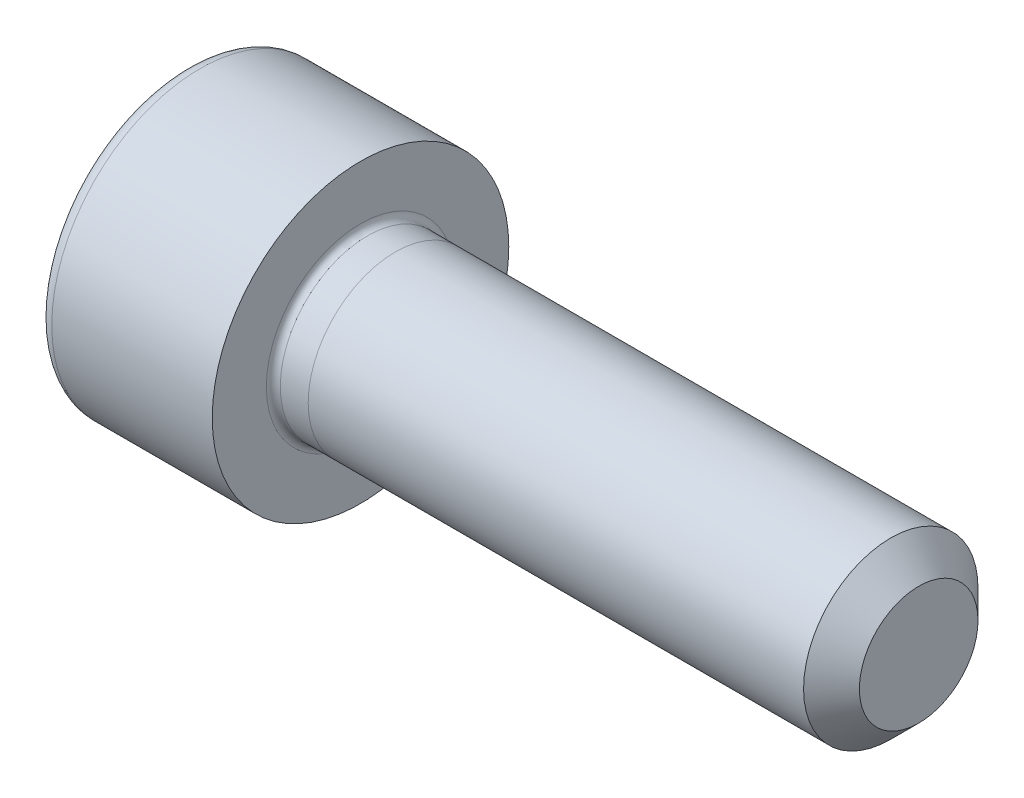
ISO-10303-21;
HEADER;
FILE_DESCRIPTION(('STEP AP214'),'2;1');
FILE_NAME('part.step','',(''),(''),'','','');
FILE_SCHEMA(('AUTOMOTIVE_DESIGN { 1 0 10303 214 1 1 1 1 }'));
ENDSEC;
DATA;
#1=APPLICATION_CONTEXT('core data for automotive mechanical design processes');
#2=APPLICATION_PROTOCOL_DEFINITION('international standard','automotive_design',2000,#1);
#3=PRODUCT_CONTEXT('',#1,'mechanical');
#4=PRODUCT('Part','Part','',(#3));
#5=PRODUCT_RELATED_PRODUCT_CATEGORY('part','',(#4));
#6=PRODUCT_DEFINITION_FORMATION('','',#4);
#7=PRODUCT_DEFINITION_CONTEXT('part definition',#1,'design');
#8=PRODUCT_DEFINITION('design','',#6,#7);
#9=PRODUCT_DEFINITION_SHAPE('','',#8);
#10=(LENGTH_UNIT() NAMED_UNIT(*) SI_UNIT(.MILLI.,.METRE.));
#11=(NAMED_UNIT(*) PLANE_ANGLE_UNIT() SI_UNIT($,.RADIAN.));
#12=(NAMED_UNIT(*) SI_UNIT($,.STERADIAN.) SOLID_ANGLE_UNIT());
#13=UNCERTAINTY_MEASURE_WITH_UNIT(LENGTH_MEASURE(1.E-05),#10,'distance_accuracy_value','');
#14=(GEOMETRIC_REPRESENTATION_CONTEXT(3) GLOBAL_UNCERTAINTY_ASSIGNED_CONTEXT((#13)) GLOBAL_UNIT_ASSIGNED_CONTEXT((#10,
#11,#12)) REPRESENTATION_CONTEXT('',''));
#15=CARTESIAN_POINT('',(0.,0.,0.));
#16=DIRECTION('',(0.,0.,1.));
#17=DIRECTION('',(1.,0.,0.));
#18=AXIS2_PLACEMENT_3D('',#15,#16,#17);
#19=CARTESIAN_POINT('',(16.,0.,0.));
#20=DIRECTION('',(-1.,0.,0.));
#21=DIRECTION('',(0.,0.,1.));
#22=AXIS2_PLACEMENT_3D('',#19,#20,#21);
#23=CYLINDRICAL_SURFACE('',#22,2.5);
#24=CARTESIAN_POINT('',(0.199999999999978,0.,0.));
#25=DIRECTION('',(-1.,0.,0.));
#26=DIRECTION('',(0.,0.,1.));
#27=AXIS2_PLACEMENT_3D('',#24,#25,#26);
#28=CIRCLE('',#27,2.5);
#29=CARTESIAN_POINT('',(0.199999999999978,0.,2.5));
#30=VERTEX_POINT('',#29);
#31=EDGE_CURVE('E180',#30,#30,#28,.F.);
#32=ORIENTED_EDGE('',*,*,#31,.T.);
#33=EDGE_LOOP('',(#32));
#34=FACE_BOUND('',#33,.T.);
#35=CARTESIAN_POINT('',(1.,0.,0.));
#36=DIRECTION('',(1.,0.,0.));
#37=DIRECTION('',(0.,1.,0.));
#38=AXIS2_PLACEMENT_3D('',#35,#36,#37);
#39=CIRCLE('',#38,2.5);
#40=CARTESIAN_POINT('',(1.,2.49999999999997,0.));
#41=VERTEX_POINT('',#40);
#42=EDGE_CURVE('E11',#41,#41,#39,.T.);
#43=ORIENTED_EDGE('',*,*,#42,.F.);
#44=EDGE_LOOP('',(#43));
#45=FACE_BOUND('',#44,.T.);
#46=ADVANCED_FACE('F38',(#34,#45),#23,.T.);
#47=ORIENTED_EDGE('',*,*,#42,.T.);
#48=EDGE_LOOP('',(#47));
#49=FACE_BOUND('',#48,.T.);
#50=CARTESIAN_POINT('',(15.2,0.,0.));
#51=DIRECTION('',(1.,0.,0.));
#52=DIRECTION('',(0.,0.,-1.));
#53=AXIS2_PLACEMENT_3D('',#50,#51,#52);
#54=CIRCLE('',#53,2.5);
#55=CARTESIAN_POINT('',(15.2,0.,-2.49999999999996));
#56=VERTEX_POINT('',#55);
#57=EDGE_CURVE('E168',#56,#56,#54,.F.);
#58=ORIENTED_EDGE('',*,*,#57,.T.);
#59=EDGE_LOOP('',(#58));
#60=FACE_BOUND('',#59,.T.);
#61=ADVANCED_FACE('F277',(#49,#60),#23,.T.);
#62=CARTESIAN_POINT('',(16.,0.,0.));
#63=DIRECTION('',(1.,0.,0.));
#64=DIRECTION('',(0.,0.,-1.));
#65=AXIS2_PLACEMENT_3D('',#62,#63,#64);
#66=PLANE('',#65);
#67=CARTESIAN_POINT('',(16.,0.,0.));
#68=DIRECTION('',(1.,0.,0.));
#69=DIRECTION('',(0.,0.,-1.));
#70=AXIS2_PLACEMENT_3D('',#67,#68,#69);
#71=CIRCLE('',#70,1.7);
#72=CARTESIAN_POINT('',(16.,0.,-1.7));
#73=VERTEX_POINT('',#72);
#74=EDGE_CURVE('E165',#73,#73,#71,.T.);
#75=ORIENTED_EDGE('',*,*,#74,.T.);
#76=EDGE_LOOP('',(#75));
#77=FACE_BOUND('',#76,.T.);
#78=ADVANCED_FACE('F283',(#77),#66,.T.);
#79=CARTESIAN_POINT('',(0.,0.,0.));
#80=DIRECTION('',(-1.,0.,0.));
#81=DIRECTION('',(0.,0.,1.));
#82=AXIS2_PLACEMENT_3D('',#79,#80,#81);
#83=PLANE('',#82);
#84=CARTESIAN_POINT('',(0.,0.,0.));
#85=DIRECTION('',(-1.,0.,0.));
#86=DIRECTION('',(0.,0.,1.));
#87=AXIS2_PLACEMENT_3D('',#84,#85,#86);
#88=CIRCLE('',#87,2.7);
#89=CARTESIAN_POINT('',(0.,0.,2.7));
#90=VERTEX_POINT('',#89);
#91=EDGE_CURVE('E177',#90,#90,#88,.T.);
#92=ORIENTED_EDGE('',*,*,#91,.T.);
#93=EDGE_LOOP('',(#92));
#94=FACE_BOUND('',#93,.T.);
#95=CARTESIAN_POINT('',(0.,0.,0.));
#96=DIRECTION('',(-1.,0.,0.));
#97=DIRECTION('',(0.,0.,1.));
#98=AXIS2_PLACEMENT_3D('',#95,#96,#97);
#99=CIRCLE('',#98,4.25);
#100=CARTESIAN_POINT('',(0.,0.,4.25));
#101=VERTEX_POINT('',#100);
#102=EDGE_CURVE('E162',#101,#101,#99,.T.);
#103=ORIENTED_EDGE('',*,*,#102,.F.);
#104=EDGE_LOOP('',(#103));
#105=FACE_BOUND('',#104,.T.);
#106=ADVANCED_FACE('F309',(#94,#105),#83,.F.);
#107=CARTESIAN_POINT('',(-5.,0.,0.));
#108=DIRECTION('',(1.,0.,0.));
#109=DIRECTION('',(0.,0.,-1.));
#110=AXIS2_PLACEMENT_3D('',#107,#108,#109);
#111=CYLINDRICAL_SURFACE('',#110,4.25);
#112=CARTESIAN_POINT('',(-4.59999999999999,0.,0.));
#113=DIRECTION('',(-1.,0.,0.));
#114=DIRECTION('',(0.,0.,1.));
#115=AXIS2_PLACEMENT_3D('',#112,#113,#114);
#116=CIRCLE('',#115,4.25);
#117=CARTESIAN_POINT('',(-4.59999999999999,0.,4.25000000000001));
#118=VERTEX_POINT('',#117);
#119=EDGE_CURVE('E174',#118,#118,#116,.F.);
#120=ORIENTED_EDGE('',*,*,#119,.T.);
#121=EDGE_LOOP('',(#120));
#122=FACE_BOUND('',#121,.T.);
#123=ORIENTED_EDGE('',*,*,#102,.T.);
#124=EDGE_LOOP('',(#123));
#125=FACE_BOUND('',#124,.T.);
#126=ADVANCED_FACE('F312',(#122,#125),#111,.T.);
#127=CARTESIAN_POINT('',(-5.,0.,0.));
#128=DIRECTION('',(-1.,0.,0.));
#129=DIRECTION('',(0.,0.,1.));
#130=AXIS2_PLACEMENT_3D('',#127,#128,#129);
#131=PLANE('',#130);
#132=CARTESIAN_POINT('',(-5.,0.,0.));
#133=DIRECTION('',(-1.,0.,0.));
#134=DIRECTION('',(0.,0.,1.));
#135=AXIS2_PLACEMENT_3D('',#132,#133,#134);
#136=CIRCLE('',#135,2.4);
#137=CARTESIAN_POINT('',(-5.,0.,2.40000000000001));
#138=VERTEX_POINT('',#137);
#139=EDGE_CURVE('E183',#138,#138,#136,.F.);
#140=ORIENTED_EDGE('',*,*,#139,.T.);
#141=EDGE_LOOP('',(#140));
#142=FACE_BOUND('',#141,.T.);
#143=CARTESIAN_POINT('',(-5.,0.,0.));
#144=DIRECTION('',(-1.,0.,0.));
#145=DIRECTION('',(0.,0.,1.));
#146=AXIS2_PLACEMENT_3D('',#143,#144,#145);
#147=CIRCLE('',#146,3.85);
#148=CARTESIAN_POINT('',(-5.00000000000001,0.,3.85000000000001));
#149=VERTEX_POINT('',#148);
#150=EDGE_CURVE('E171',#149,#149,#147,.T.);
#151=ORIENTED_EDGE('',*,*,#150,.T.);
#152=EDGE_LOOP('',(#151));
#153=FACE_BOUND('',#152,.T.);
#154=ADVANCED_FACE('F293',(#142,#153),#131,.T.);
#155=CARTESIAN_POINT('',(16.,0.,0.));
#156=DIRECTION('',(-1.,0.,0.));
#157=DIRECTION('',(0.,0.,1.));
#158=AXIS2_PLACEMENT_3D('',#155,#156,#157);
#159=CONICAL_SURFACE('',#158,1.7,0.785398163397446);
#160=ORIENTED_EDGE('',*,*,#57,.F.);
#161=EDGE_LOOP('',(#160));
#162=FACE_BOUND('',#161,.T.);
#163=ORIENTED_EDGE('',*,*,#74,.F.);
#164=EDGE_LOOP('',(#163));
#165=FACE_BOUND('',#164,.T.);
#166=ADVANCED_FACE('F289',(#162,#165),#159,.T.);
#167=CARTESIAN_POINT('',(-4.59999999999999,0.,0.));
#168=DIRECTION('',(-1.,0.,0.));
#169=DIRECTION('',(0.,0.,1.));
#170=AXIS2_PLACEMENT_3D('',#167,#168,#169);
#171=TOROIDAL_SURFACE('',#170,3.85,0.4);
#172=ORIENTED_EDGE('',*,*,#119,.F.);
#173=EDGE_LOOP('',(#172));
#174=FACE_BOUND('',#173,.T.);
#175=ORIENTED_EDGE('',*,*,#150,.F.);
#176=EDGE_LOOP('',(#175));
#177=FACE_BOUND('',#176,.T.);
#178=ADVANCED_FACE('F292',(#174,#177),#171,.T.);
#179=CARTESIAN_POINT('',(0.199999999999978,0.,0.));
#180=DIRECTION('',(-1.,0.,0.));
#181=DIRECTION('',(0.,0.,1.));
#182=AXIS2_PLACEMENT_3D('',#179,#180,#181);
#183=TOROIDAL_SURFACE('',#182,2.7,0.2);
#184=ORIENTED_EDGE('',*,*,#31,.F.);
#185=EDGE_LOOP('',(#184));
#186=FACE_BOUND('',#185,.T.);
#187=ORIENTED_EDGE('',*,*,#91,.F.);
#188=EDGE_LOOP('',(#187));
#189=FACE_BOUND('',#188,.T.);
#190=ADVANCED_FACE('F296',(#186,#189),#183,.F.);
#191=CARTESIAN_POINT('',(-4.76905989232412,0.,0.));
#192=DIRECTION('',(-1.,0.,0.));
#193=DIRECTION('',(0.,0.,1.));
#194=AXIS2_PLACEMENT_3D('',#191,#192,#193);
#195=CONICAL_SURFACE('',#194,2.,1.0471975511966);
#196=CARTESIAN_POINT('',(-4.94775935894465,0.000200000000005751,-2.3095165468123));
#197=CARTESIAN_POINT('',(-4.91844942842481,-0.087691262900059,-2.25877250251755));
#198=CARTESIAN_POINT('',(-4.8917927443046,-0.176341194473595,-2.20759044065994));
#199=CARTESIAN_POINT('',(-4.84526238334485,-0.355176246997811,-2.10433997494455));
#200=CARTESIAN_POINT('',(-4.82540516870691,-0.445364546505047,-2.05226973594629));
#201=CARTESIAN_POINT('',(-4.79449335634738,-0.624623385763312,-1.9487745968459));
#202=CARTESIAN_POINT('',(-4.78323304392266,-0.713666338226305,-1.89736562427194));
#203=CARTESIAN_POINT('',(-4.76978855491878,-0.892171397785061,-1.79430568008402));
#204=CARTESIAN_POINT('',(-4.76759324727761,-0.981632855703997,-1.74265508327248));
#205=CARTESIAN_POINT('',(-4.77215088165479,-1.14880835354883,-1.64613626458984));
#206=CARTESIAN_POINT('',(-4.77778476701115,-1.2265473702658,-1.60125362236172));
#207=CARTESIAN_POINT('',(-4.79564378758496,-1.38151891453613,-1.51178075956048));
#208=CARTESIAN_POINT('',(-4.80787502834758,-1.4587509057412,-1.4671908486482));
#209=CARTESIAN_POINT('',(-4.83845332919175,-1.6140421864822,-1.37753338590959));
#210=CARTESIAN_POINT('',(-4.85693005938985,-1.69208181310737,-1.33247718647008));
#211=CARTESIAN_POINT('',(-4.89886541053699,-1.84699686569212,-1.24303693915875));
#212=CARTESIAN_POINT('',(-4.92231417281645,-1.9238742776231,-1.19865174468579));
#213=CARTESIAN_POINT('',(-4.94775935894465,-2.00019999999998,-1.15458506832541));
#214=B_SPLINE_CURVE_WITH_KNOTS('',3,(#196,#197,#198,#199,#200,#201,#202,#203,#204,#205,#206,
#207,#208,#209,#210,#211,#212,#213),.UNSPECIFIED.,.F.,.F.,(4,2,2,2,2,2,2,2,4),(0.,
0.317031824695614,0.634825876346569,0.944753967652642,1.25430138000372,1.52387047293094,
1.79368946861027,2.06949491027632,2.3447585082147),.UNSPECIFIED.);
#215=CARTESIAN_POINT('',(-4.94769268727824,0.,-2.30940107675848));
#216=VERTEX_POINT('',#215);
#217=CARTESIAN_POINT('',(-4.94769268727824,-1.99999999999995,-1.15470053837927));
#218=VERTEX_POINT('',#217);
#219=EDGE_CURVE('E237',#216,#218,#214,.T.);
#220=ORIENTED_EDGE('',*,*,#219,.F.);
#221=CARTESIAN_POINT('',(-4.94775935894465,2.00020000000004,-1.15458506832539));
#222=CARTESIAN_POINT('',(-4.91844942842481,1.91230873709997,-1.20532911262015));
#223=CARTESIAN_POINT('',(-4.89179274430459,1.82365880552644,-1.25651117447777));
#224=CARTESIAN_POINT('',(-4.84526238334484,1.64482375300222,-1.35976164019317));
#225=CARTESIAN_POINT('',(-4.8254051687069,1.55463545349498,-1.41183187919143));
#226=CARTESIAN_POINT('',(-4.79449335634737,1.37537661423671,-1.51532701829182));
#227=CARTESIAN_POINT('',(-4.78323304392264,1.28633366177371,-1.56673599086577));
#228=CARTESIAN_POINT('',(-4.76978855491877,1.10782860221496,-1.66979593505372));
#229=CARTESIAN_POINT('',(-4.76759324727761,1.01836714429604,-1.7214465318653));
#230=CARTESIAN_POINT('',(-4.77215088165479,0.851191646451192,-1.81796535054793));
#231=CARTESIAN_POINT('',(-4.77778476701114,0.773452629734206,-1.86284799277603));
#232=CARTESIAN_POINT('',(-4.79564378758495,0.618481085463856,-1.95232085557725));
#233=CARTESIAN_POINT('',(-4.80787502834756,0.541249094258791,-1.99691076648954));
#234=CARTESIAN_POINT('',(-4.83845332919174,0.385957813517788,-2.08656822922816));
#235=CARTESIAN_POINT('',(-4.85693005938984,0.307918186892609,-2.13162442866766));
#236=CARTESIAN_POINT('',(-4.89886541053699,0.153003134307854,-2.221064675979));
#237=CARTESIAN_POINT('',(-4.92231417281645,0.0761257223768703,-2.26544987045196));
#238=CARTESIAN_POINT('',(-4.94775935894465,-0.000200000000005751,-2.30951654681234));
#239=B_SPLINE_CURVE_WITH_KNOTS('',3,(#221,#222,#223,#224,#225,#226,#227,#228,#229,#230,#231,
#232,#233,#234,#235,#236,#237,#238),.UNSPECIFIED.,.F.,.F.,(4,2,2,2,2,2,2,2,4),(0.,
0.317031824695627,0.634825876346591,0.944753967652676,1.25430138000377,1.523870472931,
1.79368946861034,2.0694949102764,2.34475850821479),.UNSPECIFIED.);
#240=CARTESIAN_POINT('',(-4.94769268727824,2.00000000000003,-1.15470053837924));
#241=VERTEX_POINT('',#240);
#242=EDGE_CURVE('E214',#241,#216,#239,.T.);
#243=ORIENTED_EDGE('',*,*,#242,.F.);
#244=CARTESIAN_POINT('',(-5.7296245130441,2.,-3.06969706647028));
#245=CARTESIAN_POINT('',(-5.68750761154934,2.00000000000002,-2.98260702760984));
#246=CARTESIAN_POINT('',(-5.64580390848698,2.00000000000003,-2.8953135951495));
#247=CARTESIAN_POINT('',(-5.56345596036491,2.00000000000003,-2.72021165343405));
#248=CARTESIAN_POINT('',(-5.52281188889613,2.00000000000003,-2.63240306263539));
#249=CARTESIAN_POINT('',(-5.44260488331756,2.00000000000003,-2.45569454632304));
#250=CARTESIAN_POINT('',(-5.40304932826782,2.00000000000003,-2.36679125959118));
#251=CARTESIAN_POINT('',(-5.32560029447873,2.00000000000003,-2.18826628410369));
#252=CARTESIAN_POINT('',(-5.28770673495887,2.00000000000003,-2.09864463051492));
#253=CARTESIAN_POINT('',(-5.21288954587424,2.00000000000003,-1.91577344840972));
#254=CARTESIAN_POINT('',(-5.1760313704263,2.00000000000003,-1.82249699059148));
#255=CARTESIAN_POINT('',(-5.10518283158684,2.00000000000003,-1.63484103533505));
#256=CARTESIAN_POINT('',(-5.07119279447057,2.00000000000003,-1.54046141378923));
#257=CARTESIAN_POINT('',(-5.00699637104713,2.00000000000003,-1.35063624877524));
#258=CARTESIAN_POINT('',(-4.97678203952794,2.00000000000002,-1.25519342016053));
#259=CARTESIAN_POINT('',(-4.92112753019565,2.00000000000004,-1.06293935737286));
#260=CARTESIAN_POINT('',(-4.89568581427327,2.00000000000006,-0.966128574914693));
#261=CARTESIAN_POINT('',(-4.85095209042622,2.00000000000006,-0.771614672106002));
#262=CARTESIAN_POINT('',(-4.83162795344868,2.00000000000004,-0.673919082405816));
#263=CARTESIAN_POINT('',(-4.80024257522784,2.00000000000002,-0.477348057700167));
#264=CARTESIAN_POINT('',(-4.78818070998057,2.00000000000003,-0.378472724807782));
#265=CARTESIAN_POINT('',(-4.77244384927367,2.00000000000003,-0.181309994953027));
#266=CARTESIAN_POINT('',(-4.76866358667925,2.00000000000004,-0.0830312460429689));
#267=CARTESIAN_POINT('',(-4.76952313075927,2.00000000000002,0.113485509919459));
#268=CARTESIAN_POINT('',(-4.77416316778038,2.00000000000001,0.211723515783724));
#269=CARTESIAN_POINT('',(-4.79516424597696,2.,0.449358015625662));
#270=CARTESIAN_POINT('',(-4.81568943998104,2.00000000000002,0.588388308666211));
#271=CARTESIAN_POINT('',(-4.86992569623103,2.00000000000004,0.863858384666757));
#272=CARTESIAN_POINT('',(-4.90365012014143,2.00000000000003,1.00029539521148));
#273=CARTESIAN_POINT('',(-4.98146210262977,2.00000000000003,1.27331112375956));
#274=CARTESIAN_POINT('',(-5.02575865262952,2.00000000000003,1.4098286752554));
#275=CARTESIAN_POINT('',(-5.12124259085567,2.00000000000003,1.68033618831136));
#276=CARTESIAN_POINT('',(-5.17242790952426,2.00000000000003,1.81432689526777));
#277=CARTESIAN_POINT('',(-5.29449531516151,2.00000000000003,2.11741952061406));
#278=CARTESIAN_POINT('',(-5.36689239539111,2.00000000000003,2.2859050119817));
#279=CARTESIAN_POINT('',(-5.51669751243031,2.00000000000003,2.62064677617024));
#280=CARTESIAN_POINT('',(-5.59410667028059,2.00000000000003,2.78690254016499));
#281=CARTESIAN_POINT('',(-5.75234923578388,2.00000000000003,3.11794960660755));
#282=CARTESIAN_POINT('',(-5.83318562186147,2.00000000000003,3.28273947819277));
#283=CARTESIAN_POINT('',(-5.99719159006481,2.00000000000003,3.61115513686861));
#284=CARTESIAN_POINT('',(-6.08036124351998,2.00000000000003,3.77478088817924));
#285=CARTESIAN_POINT('',(-6.24182997829835,2.00000000000003,4.08845140851658));
#286=CARTESIAN_POINT('',(-6.32000359320683,2.00000000000003,4.23856092803466));
#287=CARTESIAN_POINT('',(-6.47743207719216,2.00000000000003,4.53821671672567));
#288=CARTESIAN_POINT('',(-6.55668697774608,2.00000000000003,4.68776296933905));
#289=CARTESIAN_POINT('',(-6.71585227409501,2.00000000000003,4.98608322935768));
#290=CARTESIAN_POINT('',(-6.79576084485697,2.00000000000003,5.1348582118245));
#291=CARTESIAN_POINT('',(-6.95623484615692,2.00000000000003,5.43204425779148));
#292=CARTESIAN_POINT('',(-7.03680024437928,2.00000000000002,5.58045533873371));
#293=CARTESIAN_POINT('',(-7.11761287236257,2.,5.72873071831081));
#294=B_SPLINE_CURVE_WITH_KNOTS('',3,(#244,#245,#246,#247,#248,#249,#250,#251,#252,#253,#254,
#255,#256,#257,#258,#259,#260,#261,#262,#263,#264,#265,#266,#267,#268,#269,#270,#271,#272,#273,
#274,#275,#276,#277,#278,#279,#280,#281,#282,#283,#284,#285,#286,#287,#288,#289,#290,#291,#292,
#293),.UNSPECIFIED.,.F.,.F.,(4,2,2,2,2,2,2,2,2,2,2,2,2,2,2,2,2,2,2,2,2,2,2,2,4),(0.,
0.290221855965848,0.580490961635773,0.872395030380335,1.16428489550747,1.46513250000125,
1.76601428247192,2.06625185869287,2.36639250807089,2.6649296354442,2.9634411076283,
3.25813564536259,3.55283824491537,3.97358015663301,4.39474909430442,4.82505701428421,
5.25523594641711,5.8052445091099,6.35537651886982,6.90599683350137,7.45663399931509,
7.96436452021769,8.4721098532279,8.97873847526988,9.48534232003233),.UNSPECIFIED.);
#295=CARTESIAN_POINT('',(-4.94769268727824,2.,1.15470053837927));
#296=VERTEX_POINT('',#295);
#297=EDGE_CURVE('E192',#296,#241,#294,.F.);
#298=ORIENTED_EDGE('',*,*,#297,.F.);
#299=CARTESIAN_POINT('',(-4.94775935894465,-0.000200000000005751,2.30951654681238));
#300=CARTESIAN_POINT('',(-4.91844942842481,0.0876912629000481,2.2587725025176));
#301=CARTESIAN_POINT('',(-4.89179274430459,0.176341194473582,2.20759044065998));
#302=CARTESIAN_POINT('',(-4.84526238334484,0.355176246997803,2.10433997494458));
#303=CARTESIAN_POINT('',(-4.8254051687069,0.445364546505044,2.05226973594632));
#304=CARTESIAN_POINT('',(-4.79449335634737,0.624623385763318,1.94877459684593));
#305=CARTESIAN_POINT('',(-4.78323304392264,0.713666338226315,1.89736562427196));
#306=CARTESIAN_POINT('',(-4.76978855491877,0.892171397785079,1.79430568008404));
#307=CARTESIAN_POINT('',(-4.76759324727761,0.98163285570402,1.74265508327249));
#308=CARTESIAN_POINT('',(-4.77215088165479,1.14880835354886,1.64613626458985));
#309=CARTESIAN_POINT('',(-4.77778476701114,1.22654737026583,1.60125362236173));
#310=CARTESIAN_POINT('',(-4.79564378758494,1.38151891453616,1.51178075956049));
#311=CARTESIAN_POINT('',(-4.80787502834756,1.45875090574123,1.46719084864821));
#312=CARTESIAN_POINT('',(-4.83845332919173,1.61404218648223,1.37753338590959));
#313=CARTESIAN_POINT('',(-4.85693005938983,1.69208181310741,1.33247718647009));
#314=CARTESIAN_POINT('',(-4.89886541053698,1.84699686569216,1.24303693915876));
#315=CARTESIAN_POINT('',(-4.92231417281644,1.92387427762315,1.19865174468581));
#316=CARTESIAN_POINT('',(-4.94775935894465,2.00020000000004,1.15458506832546));
#317=B_SPLINE_CURVE_WITH_KNOTS('',3,(#299,#300,#301,#302,#303,#304,#305,#306,#307,#308,#309,
#310,#311,#312,#313,#314,#315,#316),.UNSPECIFIED.,.F.,.F.,(4,2,2,2,2,2,2,2,4),(0.,
0.317031824695631,0.6348258763466,0.944753967652689,1.25430138000378,1.52387047293101,
1.79368946861034,2.06949491027639,2.34475850821477),.UNSPECIFIED.);
#318=CARTESIAN_POINT('',(-4.94769268727824,0.,2.30940107675853));
#319=VERTEX_POINT('',#318);
#320=EDGE_CURVE('E186',#319,#296,#317,.T.);
#321=ORIENTED_EDGE('',*,*,#320,.F.);
#322=CARTESIAN_POINT('',(-4.94775935894465,-2.00019999999998,1.15458506832546));
#323=CARTESIAN_POINT('',(-4.91844942842481,-1.91230873709991,1.20532911262019));
#324=CARTESIAN_POINT('',(-4.89179274430459,-1.82365880552637,1.25651117447781));
#325=CARTESIAN_POINT('',(-4.84526238334484,-1.64482375300216,1.3597616401932));
#326=CARTESIAN_POINT('',(-4.8254051687069,-1.55463545349493,1.41183187919146));
#327=CARTESIAN_POINT('',(-4.79449335634737,-1.37537661423666,1.51532701829183));
#328=CARTESIAN_POINT('',(-4.78323304392264,-1.28633366177365,1.56673599086577));
#329=CARTESIAN_POINT('',(-4.76978855491877,-1.10782860221493,1.66979593505375));
#330=CARTESIAN_POINT('',(-4.76759324727761,-1.01836714429604,1.72144653186538));
#331=CARTESIAN_POINT('',(-4.77215088165479,-0.85119164645119,1.817965350548));
#332=CARTESIAN_POINT('',(-4.77778476701114,-0.773452629734182,1.86284799277605));
#333=CARTESIAN_POINT('',(-4.79564378758494,-0.618481085463816,1.95232085557724));
#334=CARTESIAN_POINT('',(-4.80787502834756,-0.541249094258758,1.99691076648955));
#335=CARTESIAN_POINT('',(-4.83845332919173,-0.385957813517759,2.08656822922817));
#336=CARTESIAN_POINT('',(-4.85693005938983,-0.307918186892577,2.13162442866767));
#337=CARTESIAN_POINT('',(-4.89886541053698,-0.153003134307826,2.22106467597901));
#338=CARTESIAN_POINT('',(-4.92231417281644,-0.0761257223768489,2.26544987045198));
#339=CARTESIAN_POINT('',(-4.94775935894465,0.000200000000005751,2.3095165468124));
#340=B_SPLINE_CURVE_WITH_KNOTS('',3,(#322,#323,#324,#325,#326,#327,#328,#329,#330,#331,#332,
#333,#334,#335,#336,#337,#338,#339),.UNSPECIFIED.,.F.,.F.,(4,2,2,2,2,2,2,2,4),(0.,
0.317031824695616,0.634825876346568,0.944753967652641,1.25430138000372,1.52387047293095,
1.79368946861029,2.06949491027635,2.34475850821473),.UNSPECIFIED.);
#341=CARTESIAN_POINT('',(-4.94769268727824,-1.99999999999997,1.15470053837924));
#342=VERTEX_POINT('',#341);
#343=EDGE_CURVE('E120',#342,#319,#340,.T.);
#344=ORIENTED_EDGE('',*,*,#343,.F.);
#345=CARTESIAN_POINT('',(-5.72962451304404,-2.,-3.0696970664703));
#346=CARTESIAN_POINT('',(-5.68750761154931,-1.99999999999997,-2.98260702760984));
#347=CARTESIAN_POINT('',(-5.64580390848696,-1.99999999999995,-2.8953135951495));
#348=CARTESIAN_POINT('',(-5.5634559603649,-1.99999999999994,-2.72021165343405));
#349=CARTESIAN_POINT('',(-5.52281188889612,-1.99999999999994,-2.63240306263539));
#350=CARTESIAN_POINT('',(-5.44260488331754,-1.99999999999995,-2.45569454632304));
#351=CARTESIAN_POINT('',(-5.4030493282678,-1.99999999999995,-2.36679125959118));
#352=CARTESIAN_POINT('',(-5.32560029447872,-1.99999999999994,-2.18826628410369));
#353=CARTESIAN_POINT('',(-5.28770673495886,-1.99999999999994,-2.09864463051492));
#354=CARTESIAN_POINT('',(-5.21288954587423,-1.99999999999995,-1.91577344840973));
#355=CARTESIAN_POINT('',(-5.17603137042628,-1.99999999999995,-1.82249699059148));
#356=CARTESIAN_POINT('',(-5.10518283158683,-1.99999999999994,-1.63484103533506));
#357=CARTESIAN_POINT('',(-5.07119279447057,-1.99999999999994,-1.54046141378924));
#358=CARTESIAN_POINT('',(-5.00699637104712,-1.99999999999995,-1.35063624877525));
#359=CARTESIAN_POINT('',(-4.97678203952792,-1.99999999999995,-1.25519342016054));
#360=CARTESIAN_POINT('',(-4.92112753019564,-1.99999999999994,-1.06293935737287));
#361=CARTESIAN_POINT('',(-4.89568581427327,-1.99999999999992,-0.966128574914706));
#362=CARTESIAN_POINT('',(-4.85095209042622,-1.99999999999992,-0.771614672106016));
#363=CARTESIAN_POINT('',(-4.83162795344866,-1.99999999999994,-0.673919082405831));
#364=CARTESIAN_POINT('',(-4.80024257522783,-1.99999999999995,-0.477348057700183));
#365=CARTESIAN_POINT('',(-4.78818070998055,-1.99999999999995,-0.378472724807797));
#366=CARTESIAN_POINT('',(-4.77244384927365,-1.99999999999994,-0.181309994953041));
#367=CARTESIAN_POINT('',(-4.76866358667923,-1.99999999999993,-0.0830312460429837));
#368=CARTESIAN_POINT('',(-4.76952313075925,-1.99999999999996,0.113485509919444));
#369=CARTESIAN_POINT('',(-4.77416316778037,-1.99999999999999,0.211723515783709));
#370=CARTESIAN_POINT('',(-4.79516424597696,-2.00000000000001,0.449358015625649));
#371=CARTESIAN_POINT('',(-4.81568943998103,-1.99999999999996,0.588388308666201));
#372=CARTESIAN_POINT('',(-4.869925696231,-1.99999999999993,0.863858384666749));
#373=CARTESIAN_POINT('',(-4.90365012014141,-1.99999999999994,1.00029539521147));
#374=CARTESIAN_POINT('',(-4.98146210262975,-1.99999999999995,1.27331112375955));
#375=CARTESIAN_POINT('',(-5.0257586526295,-1.99999999999994,1.40982867525539));
#376=CARTESIAN_POINT('',(-5.12124259085565,-1.99999999999995,1.68033618831135));
#377=CARTESIAN_POINT('',(-5.17242790952425,-1.99999999999997,1.81432689526776));
#378=CARTESIAN_POINT('',(-5.29449531516151,-1.99999999999998,2.11741952061405));
#379=CARTESIAN_POINT('',(-5.3668923953911,-1.99999999999995,2.28590501198169));
#380=CARTESIAN_POINT('',(-5.51669751243029,-1.99999999999994,2.62064677617024));
#381=CARTESIAN_POINT('',(-5.59410667028058,-1.99999999999994,2.78690254016499));
#382=CARTESIAN_POINT('',(-5.75234923578387,-1.99999999999995,3.11794960660756));
#383=CARTESIAN_POINT('',(-5.83318562186146,-1.99999999999994,3.28273947819278));
#384=CARTESIAN_POINT('',(-5.9971915900648,-1.99999999999994,3.61115513686861));
#385=CARTESIAN_POINT('',(-6.08036124351997,-1.99999999999994,3.77478088817925));
#386=CARTESIAN_POINT('',(-6.24182997829834,-1.99999999999994,4.08845140851659));
#387=CARTESIAN_POINT('',(-6.32000359320683,-1.99999999999994,4.23856092803467));
#388=CARTESIAN_POINT('',(-6.47743207719215,-1.99999999999994,4.53821671672568));
#389=CARTESIAN_POINT('',(-6.55668697774608,-1.99999999999995,4.68776296933906));
#390=CARTESIAN_POINT('',(-6.71585227409501,-1.99999999999994,4.98608322935769));
#391=CARTESIAN_POINT('',(-6.79576084485697,-1.99999999999993,5.1348582118245));
#392=CARTESIAN_POINT('',(-6.95623484615692,-1.99999999999995,5.4320442577915));
#393=CARTESIAN_POINT('',(-7.03680024437928,-1.99999999999998,5.58045533873372));
#394=CARTESIAN_POINT('',(-7.11761287236257,-2.00000000000006,5.72873071831083));
#395=B_SPLINE_CURVE_WITH_KNOTS('',3,(#345,#346,#347,#348,#349,#350,#351,#352,#353,#354,#355,
#356,#357,#358,#359,#360,#361,#362,#363,#364,#365,#366,#367,#368,#369,#370,#371,#372,#373,#374,
#375,#376,#377,#378,#379,#380,#381,#382,#383,#384,#385,#386,#387,#388,#389,#390,#391,#392,#393,
#394),.UNSPECIFIED.,.F.,.F.,(4,2,2,2,2,2,2,2,2,2,2,2,2,2,2,2,2,2,2,2,2,2,2,2,4),(0.,
0.290221855965847,0.58049096163577,0.872395030380328,1.16428489550746,1.46513250000124,
1.7660142824719,2.06625185869285,2.36639250807086,2.66492963544418,2.96344110762828,
3.25813564536257,3.55283824491535,3.97358015663299,4.3947490943044,4.82505701428419,
5.2552359464171,5.8052445091099,6.35537651886982,6.90599683350138,7.4566339993151,
7.96436452021769,8.47210985322791,8.97873847526989,9.48534232003235),.UNSPECIFIED.);
#396=EDGE_CURVE('E220',#218,#342,#395,.T.);
#397=ORIENTED_EDGE('',*,*,#396,.F.);
#398=EDGE_LOOP('',(#220,#243,#298,#321,#344,#397));
#399=FACE_BOUND('',#398,.T.);
#400=ORIENTED_EDGE('',*,*,#139,.F.);
#401=EDGE_LOOP('',(#400));
#402=FACE_BOUND('',#401,.T.);
#403=ADVANCED_FACE('F40',(#399,#402),#195,.F.);
#404=CARTESIAN_POINT('',(-2.19999999999998,0.,2.30940107675852));
#405=DIRECTION('',(-1.,0.,0.));
#406=DIRECTION('',(0.,0.,1.));
#407=AXIS2_PLACEMENT_3D('',#404,#405,#406);
#408=PLANE('',#407);
#409=CARTESIAN_POINT('',(-2.19999999999998,0.,0.));
#410=DIRECTION('',(-1.,0.,0.));
#411=DIRECTION('',(0.,0.,1.));
#412=AXIS2_PLACEMENT_3D('',#409,#410,#411);
#413=CIRCLE('',#412,2.);
#414=CARTESIAN_POINT('',(-2.19999999999998,-1.,1.73205080756891));
#415=VERTEX_POINT('',#414);
#416=CARTESIAN_POINT('',(-2.19999999999998,-2.,0.));
#417=VERTEX_POINT('',#416);
#418=EDGE_CURVE('E48',#415,#417,#413,.F.);
#419=ORIENTED_EDGE('',*,*,#418,.T.);
#420=DIRECTION('',(0.,0.,1.));
#421=VECTOR('',#420,1.);
#422=CARTESIAN_POINT('',(-2.19999999999998,-1.99999999999995,-1.15470053837924));
#423=LINE('',#422,#421);
#424=CARTESIAN_POINT('',(-2.19999999999998,-1.99999999999997,1.15470053837925));
#425=VERTEX_POINT('',#424);
#426=EDGE_CURVE('E143',#417,#425,#423,.T.);
#427=ORIENTED_EDGE('',*,*,#426,.T.);
#428=DIRECTION('',(0.,0.866025403784438,0.5));
#429=VECTOR('',#428,1.);
#430=CARTESIAN_POINT('',(-2.19999999999998,-1.99999999999997,1.15470053837925));
#431=LINE('',#430,#429);
#432=EDGE_CURVE('E113',#425,#415,#431,.T.);
#433=ORIENTED_EDGE('',*,*,#432,.T.);
#434=EDGE_LOOP('',(#419,#427,#433));
#435=FACE_BOUND('',#434,.T.);
#436=ADVANCED_FACE('F303',(#435),#408,.T.);
#437=CARTESIAN_POINT('',(-2.19999999999998,-1.,-1.7320508075689));
#438=VERTEX_POINT('',#437);
#439=EDGE_CURVE('E244',#417,#438,#413,.F.);
#440=ORIENTED_EDGE('',*,*,#439,.T.);
#441=DIRECTION('',(0.,-0.866025403784439,0.5));
#442=VECTOR('',#441,1.);
#443=CARTESIAN_POINT('',(-2.19999999999998,0.,-2.30940107675848));
#444=LINE('',#443,#442);
#445=CARTESIAN_POINT('',(-2.19999999999998,-1.99999999999995,-1.15470053837924));
#446=VERTEX_POINT('',#445);
#447=EDGE_CURVE('E139',#438,#446,#444,.T.);
#448=ORIENTED_EDGE('',*,*,#447,.T.);
#449=EDGE_CURVE('E123',#446,#417,#423,.T.);
#450=ORIENTED_EDGE('',*,*,#449,.T.);
#451=EDGE_LOOP('',(#440,#448,#450));
#452=FACE_BOUND('',#451,.T.);
#453=ADVANCED_FACE('F358',(#452),#408,.T.);
#454=CARTESIAN_POINT('',(-2.19999999999998,0.999999999999945,-1.73205080756885));
#455=VERTEX_POINT('',#454);
#456=EDGE_CURVE('E248',#438,#455,#413,.F.);
#457=ORIENTED_EDGE('',*,*,#456,.T.);
#458=DIRECTION('',(0.,-0.866025403784438,-0.5));
#459=VECTOR('',#458,1.);
#460=CARTESIAN_POINT('',(-2.19999999999998,2.00000000000003,-1.15470053837922));
#461=LINE('',#460,#459);
#462=CARTESIAN_POINT('',(-2.19999999999998,0.,-2.30940107675848));
#463=VERTEX_POINT('',#462);
#464=EDGE_CURVE('E135',#455,#463,#461,.T.);
#465=ORIENTED_EDGE('',*,*,#464,.T.);
#466=EDGE_CURVE('E140',#463,#438,#444,.T.);
#467=ORIENTED_EDGE('',*,*,#466,.T.);
#468=EDGE_LOOP('',(#457,#465,#467));
#469=FACE_BOUND('',#468,.T.);
#470=ADVANCED_FACE('F366',(#469),#408,.T.);
#471=CARTESIAN_POINT('',(-2.19999999999998,2.00000000000003,0.));
#472=VERTEX_POINT('',#471);
#473=EDGE_CURVE('E243',#455,#472,#413,.F.);
#474=ORIENTED_EDGE('',*,*,#473,.T.);
#475=DIRECTION('',(0.,0.,-1.));
#476=VECTOR('',#475,1.);
#477=CARTESIAN_POINT('',(-2.19999999999998,2.00000000000003,1.15470053837928));
#478=LINE('',#477,#476);
#479=CARTESIAN_POINT('',(-2.19999999999998,2.00000000000003,-1.15470053837922));
#480=VERTEX_POINT('',#479);
#481=EDGE_CURVE('E129',#472,#480,#478,.T.);
#482=ORIENTED_EDGE('',*,*,#481,.T.);
#483=EDGE_CURVE('E136',#480,#455,#461,.T.);
#484=ORIENTED_EDGE('',*,*,#483,.T.);
#485=EDGE_LOOP('',(#474,#482,#484));
#486=FACE_BOUND('',#485,.T.);
#487=ADVANCED_FACE('F258',(#486),#408,.T.);
#488=CARTESIAN_POINT('',(-2.19999999999998,1.,1.73205080756895));
#489=VERTEX_POINT('',#488);
#490=EDGE_CURVE('E242',#472,#489,#413,.F.);
#491=ORIENTED_EDGE('',*,*,#490,.T.);
#492=DIRECTION('',(0.,0.866025403784438,-0.5));
#493=VECTOR('',#492,1.);
#494=CARTESIAN_POINT('',(-2.19999999999998,0.,2.30940107675852));
#495=LINE('',#494,#493);
#496=CARTESIAN_POINT('',(-2.19999999999998,2.00000000000003,1.15470053837928));
#497=VERTEX_POINT('',#496);
#498=EDGE_CURVE('E127',#489,#497,#495,.T.);
#499=ORIENTED_EDGE('',*,*,#498,.T.);
#500=EDGE_CURVE('E131',#497,#472,#478,.T.);
#501=ORIENTED_EDGE('',*,*,#500,.T.);
#502=EDGE_LOOP('',(#491,#499,#501));
#503=FACE_BOUND('',#502,.T.);
#504=ADVANCED_FACE('F266',(#503),#408,.T.);
#505=EDGE_CURVE('E59',#489,#415,#413,.F.);
#506=ORIENTED_EDGE('',*,*,#505,.T.);
#507=CARTESIAN_POINT('',(-2.19999999999998,0.,2.30940107675852));
#508=VERTEX_POINT('',#507);
#509=EDGE_CURVE('E107',#415,#508,#431,.T.);
#510=ORIENTED_EDGE('',*,*,#509,.T.);
#511=EDGE_CURVE('E55',#508,#489,#495,.T.);
#512=ORIENTED_EDGE('',*,*,#511,.T.);
#513=EDGE_LOOP('',(#506,#510,#512));
#514=FACE_BOUND('',#513,.T.);
#515=ADVANCED_FACE('F109',(#514),#408,.T.);
#516=CARTESIAN_POINT('',(-2.19999999999998,-1.99999999999997,1.15470053837925));
#517=DIRECTION('',(0.,-0.5,0.866025403784439));
#518=DIRECTION('',(0.,-0.866025403784439,-0.5));
#519=AXIS2_PLACEMENT_3D('',#516,#517,#518);
#520=PLANE('',#519);
#521=ORIENTED_EDGE('',*,*,#343,.T.);
#522=DIRECTION('',(-1.,0.,0.));
#523=VECTOR('',#522,1.);
#524=CARTESIAN_POINT('',(-2.19999999999998,0.,2.30940107675852));
#525=LINE('',#524,#523);
#526=EDGE_CURVE('E117',#508,#319,#525,.T.);
#527=ORIENTED_EDGE('',*,*,#526,.F.);
#528=ORIENTED_EDGE('',*,*,#509,.F.);
#529=ORIENTED_EDGE('',*,*,#432,.F.);
#530=DIRECTION('',(-1.,0.,0.));
#531=VECTOR('',#530,1.);
#532=CARTESIAN_POINT('',(-2.19999999999998,-1.99999999999997,1.15470053837925));
#533=LINE('',#532,#531);
#534=EDGE_CURVE('E146',#425,#342,#533,.T.);
#535=ORIENTED_EDGE('',*,*,#534,.T.);
#536=EDGE_LOOP('',(#521,#527,#528,#529,#535));
#537=FACE_BOUND('',#536,.T.);
#538=ADVANCED_FACE('F118',(#537),#520,.F.);
#539=CARTESIAN_POINT('',(-2.19999999999998,-1.99999999999995,-1.15470053837924));
#540=DIRECTION('',(0.,-1.,0.));
#541=DIRECTION('',(0.,0.,-1.));
#542=AXIS2_PLACEMENT_3D('',#539,#540,#541);
#543=PLANE('',#542);
#544=ORIENTED_EDGE('',*,*,#396,.T.);
#545=ORIENTED_EDGE('',*,*,#534,.F.);
#546=ORIENTED_EDGE('',*,*,#426,.F.);
#547=ORIENTED_EDGE('',*,*,#449,.F.);
#548=DIRECTION('',(-1.,0.,0.));
#549=VECTOR('',#548,1.);
#550=CARTESIAN_POINT('',(-2.19999999999998,-1.99999999999995,-1.15470053837924));
#551=LINE('',#550,#549);
#552=EDGE_CURVE('E149',#446,#218,#551,.T.);
#553=ORIENTED_EDGE('',*,*,#552,.T.);
#554=EDGE_LOOP('',(#544,#545,#546,#547,#553));
#555=FACE_BOUND('',#554,.T.);
#556=ADVANCED_FACE('F208',(#555),#543,.F.);
#557=CARTESIAN_POINT('',(-2.19999999999998,0.,-2.30940107675848));
#558=DIRECTION('',(0.,-0.5,-0.866025403784438));
#559=DIRECTION('',(0.,0.866025403784438,-0.5));
#560=AXIS2_PLACEMENT_3D('',#557,#558,#559);
#561=PLANE('',#560);
#562=ORIENTED_EDGE('',*,*,#219,.T.);
#563=ORIENTED_EDGE('',*,*,#552,.F.);
#564=ORIENTED_EDGE('',*,*,#447,.F.);
#565=ORIENTED_EDGE('',*,*,#466,.F.);
#566=DIRECTION('',(-1.,0.,0.));
#567=VECTOR('',#566,1.);
#568=CARTESIAN_POINT('',(-2.19999999999998,0.,-2.30940107675848));
#569=LINE('',#568,#567);
#570=EDGE_CURVE('E152',#463,#216,#569,.T.);
#571=ORIENTED_EDGE('',*,*,#570,.T.);
#572=EDGE_LOOP('',(#562,#563,#564,#565,#571));
#573=FACE_BOUND('',#572,.T.);
#574=ADVANCED_FACE('F230',(#573),#561,.F.);
#575=CARTESIAN_POINT('',(-2.19999999999998,2.00000000000003,-1.15470053837922));
#576=DIRECTION('',(0.,0.5,-0.866025403784438));
#577=DIRECTION('',(0.,0.866025403784438,0.5));
#578=AXIS2_PLACEMENT_3D('',#575,#576,#577);
#579=PLANE('',#578);
#580=ORIENTED_EDGE('',*,*,#242,.T.);
#581=ORIENTED_EDGE('',*,*,#570,.F.);
#582=ORIENTED_EDGE('',*,*,#464,.F.);
#583=ORIENTED_EDGE('',*,*,#483,.F.);
#584=DIRECTION('',(-1.,0.,0.));
#585=VECTOR('',#584,1.);
#586=CARTESIAN_POINT('',(-2.19999999999998,2.00000000000003,-1.15470053837922));
#587=LINE('',#586,#585);
#588=EDGE_CURVE('E155',#480,#241,#587,.T.);
#589=ORIENTED_EDGE('',*,*,#588,.T.);
#590=EDGE_LOOP('',(#580,#581,#582,#583,#589));
#591=FACE_BOUND('',#590,.T.);
#592=ADVANCED_FACE('F226',(#591),#579,.F.);
#593=CARTESIAN_POINT('',(-2.19999999999998,2.00000000000003,1.15470053837928));
#594=DIRECTION('',(0.,1.,0.));
#595=DIRECTION('',(0.,0.,1.));
#596=AXIS2_PLACEMENT_3D('',#593,#594,#595);
#597=PLANE('',#596);
#598=ORIENTED_EDGE('',*,*,#297,.T.);
#599=ORIENTED_EDGE('',*,*,#588,.F.);
#600=ORIENTED_EDGE('',*,*,#481,.F.);
#601=ORIENTED_EDGE('',*,*,#500,.F.);
#602=DIRECTION('',(-1.,0.,0.));
#603=VECTOR('',#602,1.);
#604=CARTESIAN_POINT('',(-2.19999999999998,2.00000000000003,1.15470053837928));
#605=LINE('',#604,#603);
#606=EDGE_CURVE('E122',#497,#296,#605,.T.);
#607=ORIENTED_EDGE('',*,*,#606,.T.);
#608=EDGE_LOOP('',(#598,#599,#600,#601,#607));
#609=FACE_BOUND('',#608,.T.);
#610=ADVANCED_FACE('F202',(#609),#597,.F.);
#611=CARTESIAN_POINT('',(-2.19999999999998,0.,2.30940107675852));
#612=DIRECTION('',(0.,0.5,0.866025403784438));
#613=DIRECTION('',(0.,-0.866025403784438,0.5));
#614=AXIS2_PLACEMENT_3D('',#611,#612,#613);
#615=PLANE('',#614);
#616=ORIENTED_EDGE('',*,*,#320,.T.);
#617=ORIENTED_EDGE('',*,*,#606,.F.);
#618=ORIENTED_EDGE('',*,*,#498,.F.);
#619=ORIENTED_EDGE('',*,*,#511,.F.);
#620=ORIENTED_EDGE('',*,*,#526,.T.);
#621=EDGE_LOOP('',(#616,#617,#618,#619,#620));
#622=FACE_BOUND('',#621,.T.);
#623=ADVANCED_FACE('F125',(#622),#615,.F.);
#624=CARTESIAN_POINT('',(-1.59999999999999,0.,0.));
#625=DIRECTION('',(-1.,0.,0.));
#626=DIRECTION('',(0.,0.,1.));
#627=AXIS2_PLACEMENT_3D('',#624,#625,#626);
#628=PLANE('',#627);
#629=CARTESIAN_POINT('',(-1.59999999999999,0.,0.));
#630=DIRECTION('',(-1.,0.,0.));
#631=DIRECTION('',(0.,0.,1.));
#632=AXIS2_PLACEMENT_3D('',#629,#630,#631);
#633=CIRCLE('',#632,2.);
#634=CARTESIAN_POINT('',(-1.59999999999999,0.,2.));
#635=VERTEX_POINT('',#634);
#636=EDGE_CURVE('E148',#635,#635,#633,.T.);
#637=ORIENTED_EDGE('',*,*,#636,.T.);
#638=EDGE_LOOP('',(#637));
#639=FACE_BOUND('',#638,.T.);
#640=ADVANCED_FACE('F201',(#639),#628,.T.);
#641=CARTESIAN_POINT('',(-1.59999999999999,0.,0.));
#642=DIRECTION('',(-1.,0.,0.));
#643=DIRECTION('',(0.,0.,1.));
#644=AXIS2_PLACEMENT_3D('',#641,#642,#643);
#645=CYLINDRICAL_SURFACE('',#644,2.);
#646=ORIENTED_EDGE('',*,*,#636,.F.);
#647=EDGE_LOOP('',(#646));
#648=FACE_BOUND('',#647,.T.);
#649=ORIENTED_EDGE('',*,*,#418,.F.);
#650=ORIENTED_EDGE('',*,*,#505,.F.);
#651=ORIENTED_EDGE('',*,*,#490,.F.);
#652=ORIENTED_EDGE('',*,*,#473,.F.);
#653=ORIENTED_EDGE('',*,*,#456,.F.);
#654=ORIENTED_EDGE('',*,*,#439,.F.);
#655=EDGE_LOOP('',(#649,#650,#651,#652,#653,#654));
#656=FACE_BOUND('',#655,.T.);
#657=ADVANCED_FACE('F267',(#648,#656),#645,.F.);
#658=CLOSED_SHELL('',(#46,#61,#78,#106,#126,#154,#166,#178,#190,#403,#436,#453,#470,#487,#504,
#515,#538,#556,#574,#592,#610,#623,#640,#657));
#659=MANIFOLD_SOLID_BREP('B2',#658);
#660=ADVANCED_BREP_SHAPE_REPRESENTATION('',(#18,#659),#14);
#661=SHAPE_DEFINITION_REPRESENTATION(#9,#660);
ENDSEC;
END-ISO-10303-21;
